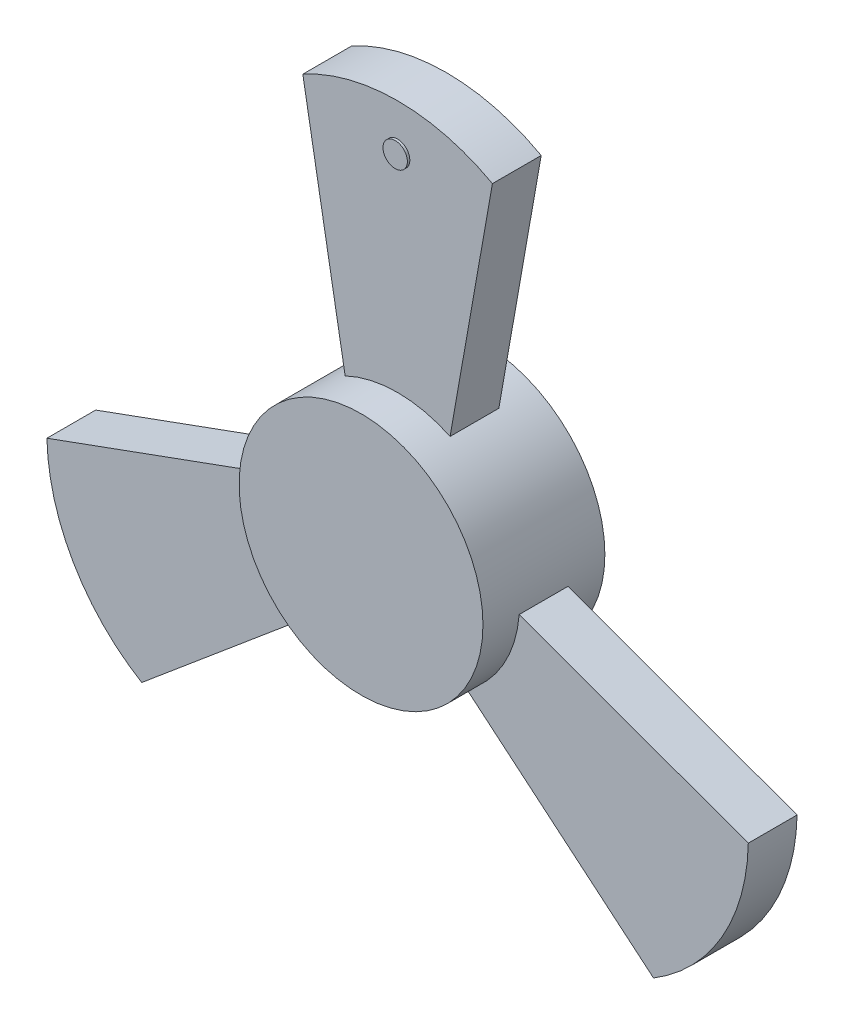
ISO-10303-21;
HEADER;
FILE_DESCRIPTION(('STEP AP214'),'2;1');
FILE_NAME('part.step','',(''),(''),'','','');
FILE_SCHEMA(('AUTOMOTIVE_DESIGN { 1 0 10303 214 1 1 1 1 }'));
ENDSEC;
DATA;
#1=APPLICATION_CONTEXT('core data for automotive mechanical design processes');
#2=APPLICATION_PROTOCOL_DEFINITION('international standard','automotive_design',2000,#1);
#3=PRODUCT_CONTEXT('',#1,'mechanical');
#4=PRODUCT('Part','Part','',(#3));
#5=PRODUCT_RELATED_PRODUCT_CATEGORY('part','',(#4));
#6=PRODUCT_DEFINITION_FORMATION('','',#4);
#7=PRODUCT_DEFINITION_CONTEXT('part definition',#1,'design');
#8=PRODUCT_DEFINITION('design','',#6,#7);
#9=PRODUCT_DEFINITION_SHAPE('','',#8);
#10=(LENGTH_UNIT() NAMED_UNIT(*) SI_UNIT(.MILLI.,.METRE.));
#11=(NAMED_UNIT(*) PLANE_ANGLE_UNIT() SI_UNIT($,.RADIAN.));
#12=(NAMED_UNIT(*) SI_UNIT($,.STERADIAN.) SOLID_ANGLE_UNIT());
#13=UNCERTAINTY_MEASURE_WITH_UNIT(LENGTH_MEASURE(1.E-05),#10,'distance_accuracy_value','');
#14=(GEOMETRIC_REPRESENTATION_CONTEXT(3) GLOBAL_UNCERTAINTY_ASSIGNED_CONTEXT((#13)) GLOBAL_UNIT_ASSIGNED_CONTEXT((#10,
#11,#12)) REPRESENTATION_CONTEXT('',''));
#15=CARTESIAN_POINT('',(0.,0.,0.));
#16=DIRECTION('',(0.,0.,1.));
#17=DIRECTION('',(1.,0.,0.));
#18=AXIS2_PLACEMENT_3D('',#15,#16,#17);
#19=CARTESIAN_POINT('',(0.,0.,25.));
#20=DIRECTION('',(0.,0.,-1.));
#21=DIRECTION('',(-1.,0.,0.));
#22=AXIS2_PLACEMENT_3D('',#19,#20,#21);
#23=CYLINDRICAL_SURFACE('',#22,50.);
#24=CARTESIAN_POINT('',(0.,0.,10.));
#25=DIRECTION('',(0.,0.,-1.));
#26=DIRECTION('',(-1.,0.,0.));
#27=AXIS2_PLACEMENT_3D('',#24,#25,#26);
#28=CIRCLE('',#27,50.);
#29=CARTESIAN_POINT('',(49.8445836091229,-3.93922388715797,10.));
#30=VERTEX_POINT('',#29);
#31=CARTESIAN_POINT('',(28.3337597620344,-41.1970637029792,10.));
#32=VERTEX_POINT('',#31);
#33=EDGE_CURVE('E156',#30,#32,#28,.T.);
#34=ORIENTED_EDGE('',*,*,#33,.F.);
#35=DIRECTION('',(0.,0.,-1.));
#36=VECTOR('',#35,1.);
#37=CARTESIAN_POINT('',(49.8445836091229,-3.93922388715797,10.));
#38=LINE('',#37,#36);
#39=CARTESIAN_POINT('',(49.8445836091229,-3.93922388715797,-10.));
#40=VERTEX_POINT('',#39);
#41=EDGE_CURVE('E165',#30,#40,#38,.T.);
#42=ORIENTED_EDGE('',*,*,#41,.T.);
#43=CARTESIAN_POINT('',(0.,0.,-10.));
#44=DIRECTION('',(0.,0.,-1.));
#45=DIRECTION('',(-1.,0.,0.));
#46=AXIS2_PLACEMENT_3D('',#43,#44,#45);
#47=CIRCLE('',#46,50.);
#48=CARTESIAN_POINT('',(28.3337597620344,-41.1970637029792,-10.));
#49=VERTEX_POINT('',#48);
#50=EDGE_CURVE('E147',#40,#49,#47,.T.);
#51=ORIENTED_EDGE('',*,*,#50,.T.);
#52=DIRECTION('',(0.,0.,-1.));
#53=VECTOR('',#52,1.);
#54=CARTESIAN_POINT('',(28.3337597620344,-41.1970637029792,10.));
#55=LINE('',#54,#53);
#56=EDGE_CURVE('E61',#32,#49,#55,.T.);
#57=ORIENTED_EDGE('',*,*,#56,.F.);
#58=EDGE_LOOP('',(#34,#42,#51,#57));
#59=FACE_BOUND('',#58,.T.);
#60=CARTESIAN_POINT('',(0.,0.,-25.));
#61=DIRECTION('',(0.,0.,1.));
#62=DIRECTION('',(1.,0.,0.));
#63=AXIS2_PLACEMENT_3D('',#60,#61,#62);
#64=CIRCLE('',#63,50.);
#65=CARTESIAN_POINT('',(50.,0.,-25.));
#66=VERTEX_POINT('',#65);
#67=EDGE_CURVE('E209',#66,#66,#64,.T.);
#68=ORIENTED_EDGE('',*,*,#67,.T.);
#69=EDGE_LOOP('',(#68));
#70=FACE_BOUND('',#69,.T.);
#71=CARTESIAN_POINT('',(0.,0.,25.));
#72=DIRECTION('',(0.,0.,1.));
#73=DIRECTION('',(1.,0.,0.));
#74=AXIS2_PLACEMENT_3D('',#71,#72,#73);
#75=CIRCLE('',#74,50.);
#76=CARTESIAN_POINT('',(50.,0.,25.));
#77=VERTEX_POINT('',#76);
#78=EDGE_CURVE('E46',#77,#77,#75,.T.);
#79=ORIENTED_EDGE('',*,*,#78,.F.);
#80=EDGE_LOOP('',(#79));
#81=FACE_BOUND('',#80,.T.);
#82=CARTESIAN_POINT('',(0.,0.,10.));
#83=DIRECTION('',(0.,0.,-1.));
#84=DIRECTION('',(-1.,0.,0.));
#85=AXIS2_PLACEMENT_3D('',#82,#83,#84);
#86=CIRCLE('',#85,50.);
#87=CARTESIAN_POINT('',(-21.5108238470884,45.1362875901368,10.));
#88=VERTEX_POINT('',#87);
#89=CARTESIAN_POINT('',(21.5108238470884,45.1362875901368,10.));
#90=VERTEX_POINT('',#89);
#91=EDGE_CURVE('E181',#88,#90,#86,.T.);
#92=ORIENTED_EDGE('',*,*,#91,.F.);
#93=DIRECTION('',(0.,0.,-1.));
#94=VECTOR('',#93,1.);
#95=CARTESIAN_POINT('',(-21.5108238470884,45.1362875901368,10.));
#96=LINE('',#95,#94);
#97=CARTESIAN_POINT('',(-21.5108238470884,45.1362875901368,-10.));
#98=VERTEX_POINT('',#97);
#99=EDGE_CURVE('E191',#88,#98,#96,.T.);
#100=ORIENTED_EDGE('',*,*,#99,.T.);
#101=CARTESIAN_POINT('',(0.,0.,-10.));
#102=DIRECTION('',(0.,0.,-1.));
#103=DIRECTION('',(-1.,0.,0.));
#104=AXIS2_PLACEMENT_3D('',#101,#102,#103);
#105=CIRCLE('',#104,50.);
#106=CARTESIAN_POINT('',(21.5108238470884,45.1362875901368,-10.));
#107=VERTEX_POINT('',#106);
#108=EDGE_CURVE('E180',#98,#107,#105,.T.);
#109=ORIENTED_EDGE('',*,*,#108,.T.);
#110=DIRECTION('',(0.,0.,-1.));
#111=VECTOR('',#110,1.);
#112=CARTESIAN_POINT('',(21.5108238470884,45.1362875901368,10.));
#113=LINE('',#112,#111);
#114=EDGE_CURVE('E207',#90,#107,#113,.T.);
#115=ORIENTED_EDGE('',*,*,#114,.F.);
#116=EDGE_LOOP('',(#92,#100,#109,#115));
#117=FACE_BOUND('',#116,.T.);
#118=CARTESIAN_POINT('',(0.,0.,10.));
#119=DIRECTION('',(0.,0.,-1.));
#120=DIRECTION('',(-1.,0.,0.));
#121=AXIS2_PLACEMENT_3D('',#118,#119,#120);
#122=CIRCLE('',#121,50.);
#123=CARTESIAN_POINT('',(-28.3337597620349,-41.1970637029788,10.));
#124=VERTEX_POINT('',#123);
#125=CARTESIAN_POINT('',(-49.844583609123,-3.93922388715727,10.));
#126=VERTEX_POINT('',#125);
#127=EDGE_CURVE('E133',#124,#126,#122,.T.);
#128=ORIENTED_EDGE('',*,*,#127,.F.);
#129=DIRECTION('',(0.,0.,-1.));
#130=VECTOR('',#129,1.);
#131=CARTESIAN_POINT('',(-28.3337597620349,-41.1970637029788,10.));
#132=LINE('',#131,#130);
#133=CARTESIAN_POINT('',(-28.3337597620349,-41.1970637029788,-10.));
#134=VERTEX_POINT('',#133);
#135=EDGE_CURVE('E413',#124,#134,#132,.T.);
#136=ORIENTED_EDGE('',*,*,#135,.T.);
#137=CARTESIAN_POINT('',(0.,0.,-10.));
#138=DIRECTION('',(0.,0.,-1.));
#139=DIRECTION('',(-1.,0.,0.));
#140=AXIS2_PLACEMENT_3D('',#137,#138,#139);
#141=CIRCLE('',#140,50.);
#142=CARTESIAN_POINT('',(-49.844583609123,-3.93922388715727,-10.));
#143=VERTEX_POINT('',#142);
#144=EDGE_CURVE('E146',#134,#143,#141,.T.);
#145=ORIENTED_EDGE('',*,*,#144,.T.);
#146=DIRECTION('',(0.,0.,-1.));
#147=VECTOR('',#146,1.);
#148=CARTESIAN_POINT('',(-49.844583609123,-3.93922388715727,10.));
#149=LINE('',#148,#147);
#150=EDGE_CURVE('E53',#126,#143,#149,.T.);
#151=ORIENTED_EDGE('',*,*,#150,.F.);
#152=EDGE_LOOP('',(#128,#136,#145,#151));
#153=FACE_BOUND('',#152,.T.);
#154=ADVANCED_FACE('F39',(#59,#70,#81,#117,#153),#23,.T.);
#155=CARTESIAN_POINT('',(0.,0.,25.));
#156=DIRECTION('',(0.,0.,1.));
#157=DIRECTION('',(1.,0.,0.));
#158=AXIS2_PLACEMENT_3D('',#155,#156,#157);
#159=PLANE('',#158);
#160=ORIENTED_EDGE('',*,*,#78,.T.);
#161=EDGE_LOOP('',(#160));
#162=FACE_BOUND('',#161,.T.);
#163=ADVANCED_FACE('F219',(#162),#159,.T.);
#164=CARTESIAN_POINT('',(0.,0.,-25.));
#165=DIRECTION('',(0.,0.,1.));
#166=DIRECTION('',(1.,0.,0.));
#167=AXIS2_PLACEMENT_3D('',#164,#165,#166);
#168=PLANE('',#167);
#169=ORIENTED_EDGE('',*,*,#67,.F.);
#170=EDGE_LOOP('',(#169));
#171=FACE_BOUND('',#170,.T.);
#172=ADVANCED_FACE('F216',(#171),#168,.F.);
#173=CARTESIAN_POINT('',(38.8756416137812,143.617062891358,10.));
#174=DIRECTION('',(-0.984807753012209,0.173648177666928,0.));
#175=DIRECTION('',(-0.173648177666928,-0.984807753012209,0.));
#176=AXIS2_PLACEMENT_3D('',#173,#174,#175);
#177=PLANE('',#176);
#178=DIRECTION('',(0.173648177666928,0.984807753012208,0.));
#179=VECTOR('',#178,1.);
#180=CARTESIAN_POINT('',(38.8756416137812,143.617062891358,-10.));
#181=LINE('',#180,#179);
#182=CARTESIAN_POINT('',(38.8756416137812,143.617062891358,-10.));
#183=VERTEX_POINT('',#182);
#184=EDGE_CURVE('E194',#107,#183,#181,.T.);
#185=ORIENTED_EDGE('',*,*,#184,.T.);
#186=DIRECTION('',(0.,0.,-1.));
#187=VECTOR('',#186,1.);
#188=CARTESIAN_POINT('',(38.8756416137812,143.617062891358,10.));
#189=LINE('',#188,#187);
#190=CARTESIAN_POINT('',(38.8756416137812,143.617062891358,10.));
#191=VERTEX_POINT('',#190);
#192=EDGE_CURVE('E204',#191,#183,#189,.T.);
#193=ORIENTED_EDGE('',*,*,#192,.F.);
#194=DIRECTION('',(0.173648177666928,0.984807753012208,0.));
#195=VECTOR('',#194,1.);
#196=CARTESIAN_POINT('',(38.8756416137812,143.617062891358,10.));
#197=LINE('',#196,#195);
#198=EDGE_CURVE('E184',#90,#191,#197,.T.);
#199=ORIENTED_EDGE('',*,*,#198,.F.);
#200=ORIENTED_EDGE('',*,*,#114,.T.);
#201=EDGE_LOOP('',(#185,#193,#199,#200));
#202=FACE_BOUND('',#201,.T.);
#203=ADVANCED_FACE('F218',(#202),#177,.F.);
#204=CARTESIAN_POINT('',(0.,73.0512873472,10.));
#205=DIRECTION('',(0.,0.,-1.));
#206=DIRECTION('',(-1.,0.,0.));
#207=AXIS2_PLACEMENT_3D('',#204,#205,#206);
#208=CYLINDRICAL_SURFACE('',#207,80.5657755441576);
#209=CARTESIAN_POINT('',(0.,73.0512873472,-10.));
#210=DIRECTION('',(0.,0.,1.));
#211=DIRECTION('',(-1.,0.,0.));
#212=AXIS2_PLACEMENT_3D('',#209,#210,#211);
#213=CIRCLE('',#212,80.5657755441576);
#214=CARTESIAN_POINT('',(-38.8756416137812,143.617062891358,-10.));
#215=VERTEX_POINT('',#214);
#216=EDGE_CURVE('E196',#183,#215,#213,.T.);
#217=ORIENTED_EDGE('',*,*,#216,.T.);
#218=DIRECTION('',(0.,0.,-1.));
#219=VECTOR('',#218,1.);
#220=CARTESIAN_POINT('',(-38.8756416137812,143.617062891358,10.));
#221=LINE('',#220,#219);
#222=CARTESIAN_POINT('',(-38.8756416137812,143.617062891358,10.));
#223=VERTEX_POINT('',#222);
#224=EDGE_CURVE('E201',#223,#215,#221,.T.);
#225=ORIENTED_EDGE('',*,*,#224,.F.);
#226=CARTESIAN_POINT('',(0.,73.0512873472,10.));
#227=DIRECTION('',(0.,0.,1.));
#228=DIRECTION('',(-1.,0.,0.));
#229=AXIS2_PLACEMENT_3D('',#226,#227,#228);
#230=CIRCLE('',#229,80.5657755441576);
#231=EDGE_CURVE('E187',#191,#223,#230,.T.);
#232=ORIENTED_EDGE('',*,*,#231,.F.);
#233=ORIENTED_EDGE('',*,*,#192,.T.);
#234=EDGE_LOOP('',(#217,#225,#232,#233));
#235=FACE_BOUND('',#234,.T.);
#236=ADVANCED_FACE('F224',(#235),#208,.T.);
#237=CARTESIAN_POINT('',(-21.5108238470884,45.1362875901368,10.));
#238=DIRECTION('',(0.984807753012209,0.173648177666928,0.));
#239=DIRECTION('',(-0.173648177666928,0.984807753012209,0.));
#240=AXIS2_PLACEMENT_3D('',#237,#238,#239);
#241=PLANE('',#240);
#242=DIRECTION('',(0.173648177666928,-0.984807753012208,0.));
#243=VECTOR('',#242,1.);
#244=CARTESIAN_POINT('',(-21.5108238470884,45.1362875901368,-10.));
#245=LINE('',#244,#243);
#246=EDGE_CURVE('E185',#215,#98,#245,.T.);
#247=ORIENTED_EDGE('',*,*,#246,.T.);
#248=ORIENTED_EDGE('',*,*,#99,.F.);
#249=DIRECTION('',(0.173648177666928,-0.984807753012208,0.));
#250=VECTOR('',#249,1.);
#251=CARTESIAN_POINT('',(-21.5108238470884,45.1362875901368,10.));
#252=LINE('',#251,#250);
#253=EDGE_CURVE('E189',#223,#88,#252,.T.);
#254=ORIENTED_EDGE('',*,*,#253,.F.);
#255=ORIENTED_EDGE('',*,*,#224,.T.);
#256=EDGE_LOOP('',(#247,#248,#254,#255));
#257=FACE_BOUND('',#256,.T.);
#258=ADVANCED_FACE('F265',(#257),#241,.F.);
#259=CARTESIAN_POINT('',(0.,0.,10.));
#260=DIRECTION('',(0.,0.,-1.));
#261=DIRECTION('',(-1.,0.,0.));
#262=AXIS2_PLACEMENT_3D('',#259,#260,#261);
#263=PLANE('',#262);
#264=CARTESIAN_POINT('',(0.,135.,10.));
#265=DIRECTION('',(0.,0.,-1.));
#266=DIRECTION('',(-1.,0.,0.));
#267=AXIS2_PLACEMENT_3D('',#264,#265,#266);
#268=CIRCLE('',#267,5.);
#269=CARTESIAN_POINT('',(-5.,135.,10.));
#270=VERTEX_POINT('',#269);
#271=EDGE_CURVE('E11',#270,#270,#268,.F.);
#272=ORIENTED_EDGE('',*,*,#271,.F.);
#273=EDGE_LOOP('',(#272));
#274=FACE_BOUND('',#273,.T.);
#275=ORIENTED_EDGE('',*,*,#91,.T.);
#276=ORIENTED_EDGE('',*,*,#198,.T.);
#277=ORIENTED_EDGE('',*,*,#231,.T.);
#278=ORIENTED_EDGE('',*,*,#253,.T.);
#279=EDGE_LOOP('',(#275,#276,#277,#278));
#280=FACE_BOUND('',#279,.T.);
#281=ADVANCED_FACE('F262',(#274,#280),#263,.F.);
#282=CARTESIAN_POINT('',(0.,0.,-10.));
#283=DIRECTION('',(0.,0.,-1.));
#284=DIRECTION('',(-1.,0.,0.));
#285=AXIS2_PLACEMENT_3D('',#282,#283,#284);
#286=PLANE('',#285);
#287=ORIENTED_EDGE('',*,*,#108,.F.);
#288=ORIENTED_EDGE('',*,*,#246,.F.);
#289=ORIENTED_EDGE('',*,*,#216,.F.);
#290=ORIENTED_EDGE('',*,*,#184,.F.);
#291=EDGE_LOOP('',(#287,#288,#289,#290));
#292=FACE_BOUND('',#291,.T.);
#293=ADVANCED_FACE('F258',(#292),#286,.T.);
#294=CARTESIAN_POINT('',(104.938204073932,-105.475824671633,10.));
#295=DIRECTION('',(0.642787609686541,0.766044443118977,0.));
#296=DIRECTION('',(-0.766044443118977,0.642787609686541,0.));
#297=AXIS2_PLACEMENT_3D('',#294,#295,#296);
#298=PLANE('',#297);
#299=DIRECTION('',(0.766044443118977,-0.642787609686541,0.));
#300=VECTOR('',#299,1.);
#301=CARTESIAN_POINT('',(104.938204073932,-105.475824671633,-10.));
#302=LINE('',#301,#300);
#303=CARTESIAN_POINT('',(104.938204073932,-105.475824671633,-10.));
#304=VERTEX_POINT('',#303);
#305=EDGE_CURVE('E150',#49,#304,#302,.T.);
#306=ORIENTED_EDGE('',*,*,#305,.T.);
#307=DIRECTION('',(0.,0.,-1.));
#308=VECTOR('',#307,1.);
#309=CARTESIAN_POINT('',(104.938204073932,-105.475824671633,10.));
#310=LINE('',#309,#308);
#311=CARTESIAN_POINT('',(104.938204073932,-105.475824671633,10.));
#312=VERTEX_POINT('',#311);
#313=EDGE_CURVE('E176',#312,#304,#310,.T.);
#314=ORIENTED_EDGE('',*,*,#313,.F.);
#315=DIRECTION('',(0.766044443118977,-0.642787609686541,0.));
#316=VECTOR('',#315,1.);
#317=CARTESIAN_POINT('',(104.938204073932,-105.475824671633,10.));
#318=LINE('',#317,#316);
#319=EDGE_CURVE('E159',#32,#312,#318,.T.);
#320=ORIENTED_EDGE('',*,*,#319,.F.);
#321=ORIENTED_EDGE('',*,*,#56,.T.);
#322=EDGE_LOOP('',(#306,#314,#320,#321));
#323=FACE_BOUND('',#322,.T.);
#324=ADVANCED_FACE('F248',(#323),#298,.F.);
#325=CARTESIAN_POINT('',(63.2642706218318,-36.5256436736003,10.));
#326=DIRECTION('',(0.,0.,-1.));
#327=DIRECTION('',(-1.,0.,0.));
#328=AXIS2_PLACEMENT_3D('',#325,#326,#327);
#329=CYLINDRICAL_SURFACE('',#328,80.5657755441576);
#330=CARTESIAN_POINT('',(63.2642706218318,-36.5256436736003,-10.));
#331=DIRECTION('',(0.,0.,1.));
#332=DIRECTION('',(-1.,0.,0.));
#333=AXIS2_PLACEMENT_3D('',#330,#331,#332);
#334=CIRCLE('',#333,80.5657755441576);
#335=CARTESIAN_POINT('',(143.813845687714,-38.1412382197255,-10.));
#336=VERTEX_POINT('',#335);
#337=EDGE_CURVE('E168',#304,#336,#334,.T.);
#338=ORIENTED_EDGE('',*,*,#337,.T.);
#339=DIRECTION('',(0.,0.,-1.));
#340=VECTOR('',#339,1.);
#341=CARTESIAN_POINT('',(143.813845687714,-38.1412382197255,10.));
#342=LINE('',#341,#340);
#343=CARTESIAN_POINT('',(143.813845687714,-38.1412382197255,10.));
#344=VERTEX_POINT('',#343);
#345=EDGE_CURVE('E173',#344,#336,#342,.T.);
#346=ORIENTED_EDGE('',*,*,#345,.F.);
#347=CARTESIAN_POINT('',(63.2642706218318,-36.5256436736003,10.));
#348=DIRECTION('',(0.,0.,1.));
#349=DIRECTION('',(-1.,0.,0.));
#350=AXIS2_PLACEMENT_3D('',#347,#348,#349);
#351=CIRCLE('',#350,80.5657755441576);
#352=EDGE_CURVE('E162',#312,#344,#351,.T.);
#353=ORIENTED_EDGE('',*,*,#352,.F.);
#354=ORIENTED_EDGE('',*,*,#313,.T.);
#355=EDGE_LOOP('',(#338,#346,#353,#354));
#356=FACE_BOUND('',#355,.T.);
#357=ADVANCED_FACE('F250',(#356),#329,.T.);
#358=CARTESIAN_POINT('',(49.8445836091229,-3.93922388715797,10.));
#359=DIRECTION('',(-0.342020143325676,-0.939692620785906,0.));
#360=DIRECTION('',(0.939692620785906,-0.342020143325676,0.));
#361=AXIS2_PLACEMENT_3D('',#358,#359,#360);
#362=PLANE('',#361);
#363=DIRECTION('',(-0.939692620785906,0.342020143325676,0.));
#364=VECTOR('',#363,1.);
#365=CARTESIAN_POINT('',(49.8445836091229,-3.93922388715797,-10.));
#366=LINE('',#365,#364);
#367=EDGE_CURVE('E160',#336,#40,#366,.T.);
#368=ORIENTED_EDGE('',*,*,#367,.T.);
#369=ORIENTED_EDGE('',*,*,#41,.F.);
#370=DIRECTION('',(-0.939692620785906,0.342020143325676,0.));
#371=VECTOR('',#370,1.);
#372=CARTESIAN_POINT('',(49.8445836091229,-3.93922388715797,10.));
#373=LINE('',#372,#371);
#374=EDGE_CURVE('E164',#344,#30,#373,.T.);
#375=ORIENTED_EDGE('',*,*,#374,.F.);
#376=ORIENTED_EDGE('',*,*,#345,.T.);
#377=EDGE_LOOP('',(#368,#369,#375,#376));
#378=FACE_BOUND('',#377,.T.);
#379=ADVANCED_FACE('F242',(#378),#362,.F.);
#380=CARTESIAN_POINT('',(0.,0.,10.));
#381=DIRECTION('',(0.,0.,-1.));
#382=DIRECTION('',(-1.,0.,0.));
#383=AXIS2_PLACEMENT_3D('',#380,#381,#382);
#384=PLANE('',#383);
#385=ORIENTED_EDGE('',*,*,#33,.T.);
#386=ORIENTED_EDGE('',*,*,#319,.T.);
#387=ORIENTED_EDGE('',*,*,#352,.T.);
#388=ORIENTED_EDGE('',*,*,#374,.T.);
#389=EDGE_LOOP('',(#385,#386,#387,#388));
#390=FACE_BOUND('',#389,.T.);
#391=ADVANCED_FACE('F236',(#390),#384,.F.);
#392=CARTESIAN_POINT('',(0.,0.,-10.));
#393=DIRECTION('',(0.,0.,-1.));
#394=DIRECTION('',(-1.,0.,0.));
#395=AXIS2_PLACEMENT_3D('',#392,#393,#394);
#396=PLANE('',#395);
#397=ORIENTED_EDGE('',*,*,#50,.F.);
#398=ORIENTED_EDGE('',*,*,#367,.F.);
#399=ORIENTED_EDGE('',*,*,#337,.F.);
#400=ORIENTED_EDGE('',*,*,#305,.F.);
#401=EDGE_LOOP('',(#397,#398,#399,#400));
#402=FACE_BOUND('',#401,.T.);
#403=ADVANCED_FACE('F247',(#402),#396,.T.);
#404=CARTESIAN_POINT('',(-143.813845687714,-38.1412382197235,10.));
#405=DIRECTION('',(0.342020143325663,-0.939692620785911,0.));
#406=DIRECTION('',(0.939692620785911,0.342020143325663,0.));
#407=AXIS2_PLACEMENT_3D('',#404,#405,#406);
#408=PLANE('',#407);
#409=DIRECTION('',(-0.939692620785911,-0.342020143325663,0.));
#410=VECTOR('',#409,1.);
#411=CARTESIAN_POINT('',(-143.813845687714,-38.1412382197235,-10.));
#412=LINE('',#411,#410);
#413=CARTESIAN_POINT('',(-143.813845687714,-38.1412382197235,-10.));
#414=VERTEX_POINT('',#413);
#415=EDGE_CURVE('E409',#143,#414,#412,.T.);
#416=ORIENTED_EDGE('',*,*,#415,.T.);
#417=DIRECTION('',(0.,0.,-1.));
#418=VECTOR('',#417,1.);
#419=CARTESIAN_POINT('',(-143.813845687714,-38.1412382197235,10.));
#420=LINE('',#419,#418);
#421=CARTESIAN_POINT('',(-143.813845687714,-38.1412382197235,10.));
#422=VERTEX_POINT('',#421);
#423=EDGE_CURVE('E129',#422,#414,#420,.T.);
#424=ORIENTED_EDGE('',*,*,#423,.F.);
#425=DIRECTION('',(-0.939692620785911,-0.342020143325663,0.));
#426=VECTOR('',#425,1.);
#427=CARTESIAN_POINT('',(-143.813845687714,-38.1412382197235,10.));
#428=LINE('',#427,#426);
#429=EDGE_CURVE('E125',#126,#422,#428,.T.);
#430=ORIENTED_EDGE('',*,*,#429,.F.);
#431=ORIENTED_EDGE('',*,*,#150,.T.);
#432=EDGE_LOOP('',(#416,#424,#430,#431));
#433=FACE_BOUND('',#432,.T.);
#434=ADVANCED_FACE('F127',(#433),#408,.F.);
#435=CARTESIAN_POINT('',(-63.2642706218323,-36.5256436735994,10.));
#436=DIRECTION('',(0.,0.,-1.));
#437=DIRECTION('',(-1.,0.,0.));
#438=AXIS2_PLACEMENT_3D('',#435,#436,#437);
#439=CYLINDRICAL_SURFACE('',#438,80.5657755441576);
#440=CARTESIAN_POINT('',(-63.2642706218323,-36.5256436735994,-10.));
#441=DIRECTION('',(0.,0.,1.));
#442=DIRECTION('',(-1.,0.,0.));
#443=AXIS2_PLACEMENT_3D('',#440,#441,#442);
#444=CIRCLE('',#443,80.5657755441576);
#445=CARTESIAN_POINT('',(-104.938204073934,-105.475824671632,-10.));
#446=VERTEX_POINT('',#445);
#447=EDGE_CURVE('E416',#414,#446,#444,.T.);
#448=ORIENTED_EDGE('',*,*,#447,.T.);
#449=DIRECTION('',(0.,0.,-1.));
#450=VECTOR('',#449,1.);
#451=CARTESIAN_POINT('',(-104.938204073934,-105.475824671632,10.));
#452=LINE('',#451,#450);
#453=CARTESIAN_POINT('',(-104.938204073934,-105.475824671632,10.));
#454=VERTEX_POINT('',#453);
#455=EDGE_CURVE('E152',#454,#446,#452,.T.);
#456=ORIENTED_EDGE('',*,*,#455,.F.);
#457=CARTESIAN_POINT('',(-63.2642706218323,-36.5256436735994,10.));
#458=DIRECTION('',(0.,0.,1.));
#459=DIRECTION('',(-1.,0.,0.));
#460=AXIS2_PLACEMENT_3D('',#457,#458,#459);
#461=CIRCLE('',#460,80.5657755441576);
#462=EDGE_CURVE('E132',#422,#454,#461,.T.);
#463=ORIENTED_EDGE('',*,*,#462,.F.);
#464=ORIENTED_EDGE('',*,*,#423,.T.);
#465=EDGE_LOOP('',(#448,#456,#463,#464));
#466=FACE_BOUND('',#465,.T.);
#467=ADVANCED_FACE('F344',(#466),#439,.T.);
#468=CARTESIAN_POINT('',(-28.3337597620349,-41.1970637029788,10.));
#469=DIRECTION('',(-0.64278760968653,0.766044443118986,0.));
#470=DIRECTION('',(-0.766044443118986,-0.64278760968653,0.));
#471=AXIS2_PLACEMENT_3D('',#468,#469,#470);
#472=PLANE('',#471);
#473=DIRECTION('',(0.766044443118986,0.64278760968653,0.));
#474=VECTOR('',#473,1.);
#475=CARTESIAN_POINT('',(-28.3337597620349,-41.1970637029788,-10.));
#476=LINE('',#475,#474);
#477=EDGE_CURVE('E142',#446,#134,#476,.T.);
#478=ORIENTED_EDGE('',*,*,#477,.T.);
#479=ORIENTED_EDGE('',*,*,#135,.F.);
#480=DIRECTION('',(0.766044443118986,0.64278760968653,0.));
#481=VECTOR('',#480,1.);
#482=CARTESIAN_POINT('',(-28.3337597620349,-41.1970637029788,10.));
#483=LINE('',#482,#481);
#484=EDGE_CURVE('E138',#454,#124,#483,.T.);
#485=ORIENTED_EDGE('',*,*,#484,.F.);
#486=ORIENTED_EDGE('',*,*,#455,.T.);
#487=EDGE_LOOP('',(#478,#479,#485,#486));
#488=FACE_BOUND('',#487,.T.);
#489=ADVANCED_FACE('F353',(#488),#472,.F.);
#490=CARTESIAN_POINT('',(0.,0.,10.));
#491=DIRECTION('',(0.,0.,-1.));
#492=DIRECTION('',(-1.,0.,0.));
#493=AXIS2_PLACEMENT_3D('',#490,#491,#492);
#494=PLANE('',#493);
#495=ORIENTED_EDGE('',*,*,#127,.T.);
#496=ORIENTED_EDGE('',*,*,#429,.T.);
#497=ORIENTED_EDGE('',*,*,#462,.T.);
#498=ORIENTED_EDGE('',*,*,#484,.T.);
#499=EDGE_LOOP('',(#495,#496,#497,#498));
#500=FACE_BOUND('',#499,.T.);
#501=ADVANCED_FACE('F136',(#500),#494,.F.);
#502=CARTESIAN_POINT('',(0.,0.,-10.));
#503=DIRECTION('',(0.,0.,-1.));
#504=DIRECTION('',(-1.,0.,0.));
#505=AXIS2_PLACEMENT_3D('',#502,#503,#504);
#506=PLANE('',#505);
#507=ORIENTED_EDGE('',*,*,#144,.F.);
#508=ORIENTED_EDGE('',*,*,#477,.F.);
#509=ORIENTED_EDGE('',*,*,#447,.F.);
#510=ORIENTED_EDGE('',*,*,#415,.F.);
#511=EDGE_LOOP('',(#507,#508,#509,#510));
#512=FACE_BOUND('',#511,.T.);
#513=ADVANCED_FACE('F371',(#512),#506,.T.);
#514=CARTESIAN_POINT('',(0.,135.,11.));
#515=DIRECTION('',(0.,0.,-1.));
#516=DIRECTION('',(-1.,0.,0.));
#517=AXIS2_PLACEMENT_3D('',#514,#515,#516);
#518=CYLINDRICAL_SURFACE('',#517,5.);
#519=CARTESIAN_POINT('',(0.,135.,11.));
#520=DIRECTION('',(0.,0.,1.));
#521=DIRECTION('',(1.,0.,0.));
#522=AXIS2_PLACEMENT_3D('',#519,#520,#521);
#523=CIRCLE('',#522,5.);
#524=CARTESIAN_POINT('',(5.,135.,11.));
#525=VERTEX_POINT('',#524);
#526=EDGE_CURVE('E407',#525,#525,#523,.T.);
#527=ORIENTED_EDGE('',*,*,#526,.F.);
#528=EDGE_LOOP('',(#527));
#529=FACE_BOUND('',#528,.T.);
#530=ORIENTED_EDGE('',*,*,#271,.T.);
#531=EDGE_LOOP('',(#530));
#532=FACE_BOUND('',#531,.T.);
#533=ADVANCED_FACE('F379',(#529,#532),#518,.T.);
#534=CARTESIAN_POINT('',(0.,135.,11.));
#535=DIRECTION('',(0.,0.,1.));
#536=DIRECTION('',(1.,0.,0.));
#537=AXIS2_PLACEMENT_3D('',#534,#535,#536);
#538=PLANE('',#537);
#539=ORIENTED_EDGE('',*,*,#526,.T.);
#540=EDGE_LOOP('',(#539));
#541=FACE_BOUND('',#540,.T.);
#542=ADVANCED_FACE('F389',(#541),#538,.T.);
#543=CLOSED_SHELL('',(#154,#163,#172,#203,#236,#258,#281,#293,#324,#357,#379,#391,#403,#434,
#467,#489,#501,#513,#533,#542));
#544=MANIFOLD_SOLID_BREP('B2',#543);
#545=ADVANCED_BREP_SHAPE_REPRESENTATION('',(#18,#544),#14);
#546=SHAPE_DEFINITION_REPRESENTATION(#9,#545);
ENDSEC;
END-ISO-10303-21;
